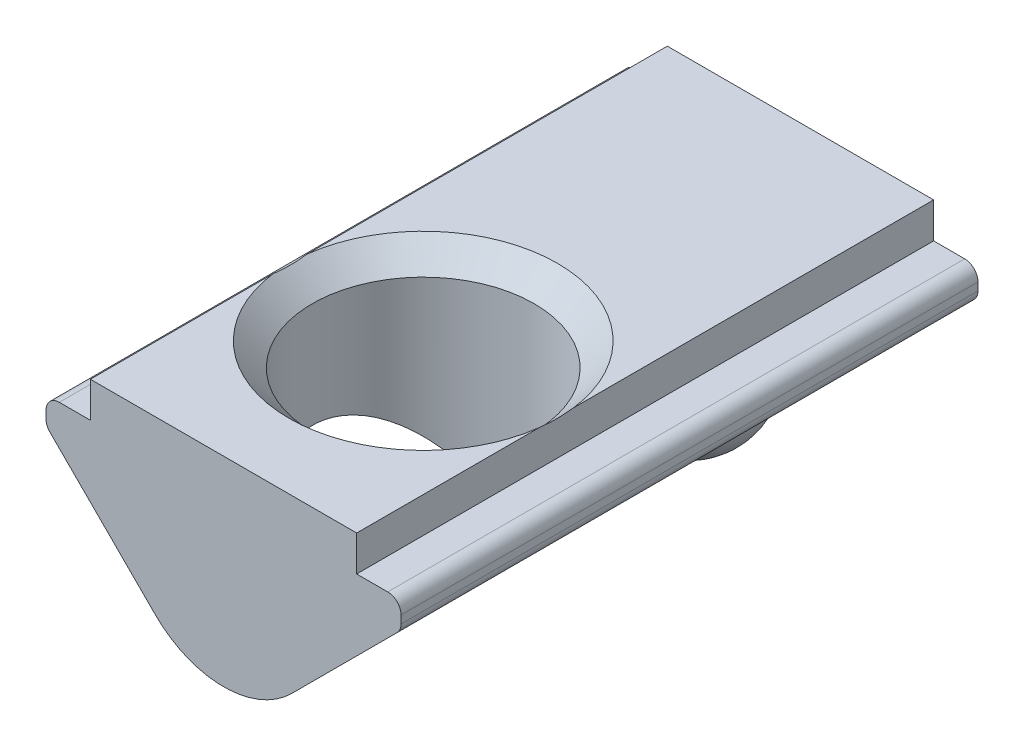
ISO-10303-21;
HEADER;
FILE_DESCRIPTION(('STEP AP214'),'2;1');
FILE_NAME('part.step','',(''),(''),'','','');
FILE_SCHEMA(('AUTOMOTIVE_DESIGN { 1 0 10303 214 1 1 1 1 }'));
ENDSEC;
DATA;
#1=APPLICATION_CONTEXT('core data for automotive mechanical design processes');
#2=APPLICATION_PROTOCOL_DEFINITION('international standard','automotive_design',2000,#1);
#3=PRODUCT_CONTEXT('',#1,'mechanical');
#4=PRODUCT('Part','Part','',(#3));
#5=PRODUCT_RELATED_PRODUCT_CATEGORY('part','',(#4));
#6=PRODUCT_DEFINITION_FORMATION('','',#4);
#7=PRODUCT_DEFINITION_CONTEXT('part definition',#1,'design');
#8=PRODUCT_DEFINITION('design','',#6,#7);
#9=PRODUCT_DEFINITION_SHAPE('','',#8);
#10=(LENGTH_UNIT() NAMED_UNIT(*) SI_UNIT(.MILLI.,.METRE.));
#11=(NAMED_UNIT(*) PLANE_ANGLE_UNIT() SI_UNIT($,.RADIAN.));
#12=(NAMED_UNIT(*) SI_UNIT($,.STERADIAN.) SOLID_ANGLE_UNIT());
#13=UNCERTAINTY_MEASURE_WITH_UNIT(LENGTH_MEASURE(1.E-05),#10,'distance_accuracy_value','');
#14=(GEOMETRIC_REPRESENTATION_CONTEXT(3) GLOBAL_UNCERTAINTY_ASSIGNED_CONTEXT((#13)) GLOBAL_UNIT_ASSIGNED_CONTEXT((#10,
#11,#12)) REPRESENTATION_CONTEXT('',''));
#15=CARTESIAN_POINT('',(0.,0.,0.));
#16=DIRECTION('',(0.,0.,1.));
#17=DIRECTION('',(1.,0.,0.));
#18=AXIS2_PLACEMENT_3D('',#15,#16,#17);
#19=CARTESIAN_POINT('',(-3.,0.,6.5));
#20=DIRECTION('',(0.,-1.,0.));
#21=DIRECTION('',(0.,0.,-1.));
#22=AXIS2_PLACEMENT_3D('',#19,#20,#21);
#23=PLANE('',#22);
#24=CARTESIAN_POINT('',(0.,0.,2.));
#25=DIRECTION('',(0.,1.,0.));
#26=DIRECTION('',(0.,0.,1.));
#27=AXIS2_PLACEMENT_3D('',#24,#25,#26);
#28=CIRCLE('',#27,3.025);
#29=CARTESIAN_POINT('',(3.,0.,1.6118956325935));
#30=VERTEX_POINT('',#29);
#31=CARTESIAN_POINT('',(-3.,0.,1.61189563259351));
#32=VERTEX_POINT('',#31);
#33=EDGE_CURVE('E416',#30,#32,#28,.T.);
#34=ORIENTED_EDGE('',*,*,#33,.F.);
#35=DIRECTION('',(0.,0.,-1.));
#36=VECTOR('',#35,1.);
#37=CARTESIAN_POINT('',(3.,0.,6.5));
#38=LINE('',#37,#36);
#39=CARTESIAN_POINT('',(3.,0.,-6.5));
#40=VERTEX_POINT('',#39);
#41=EDGE_CURVE('E200',#30,#40,#38,.T.);
#42=ORIENTED_EDGE('',*,*,#41,.T.);
#43=DIRECTION('',(-1.,0.,0.));
#44=VECTOR('',#43,1.);
#45=CARTESIAN_POINT('',(-3.,0.,-6.5));
#46=LINE('',#45,#44);
#47=CARTESIAN_POINT('',(-3.,0.,-6.5));
#48=VERTEX_POINT('',#47);
#49=EDGE_CURVE('E306',#40,#48,#46,.T.);
#50=ORIENTED_EDGE('',*,*,#49,.T.);
#51=DIRECTION('',(0.,0.,-1.));
#52=VECTOR('',#51,1.);
#53=CARTESIAN_POINT('',(-3.,0.,6.5));
#54=LINE('',#53,#52);
#55=EDGE_CURVE('E191',#32,#48,#54,.T.);
#56=ORIENTED_EDGE('',*,*,#55,.F.);
#57=EDGE_LOOP('',(#34,#42,#50,#56));
#58=FACE_BOUND('',#57,.T.);
#59=ADVANCED_FACE('F37',(#58),#23,.F.);
#60=CARTESIAN_POINT('',(-3.,0.,2.3881043674065));
#61=VERTEX_POINT('',#60);
#62=CARTESIAN_POINT('',(3.,0.,2.3881043674065));
#63=VERTEX_POINT('',#62);
#64=EDGE_CURVE('E387',#61,#63,#28,.T.);
#65=ORIENTED_EDGE('',*,*,#64,.F.);
#66=CARTESIAN_POINT('',(-3.,0.,6.5));
#67=VERTEX_POINT('',#66);
#68=EDGE_CURVE('E197',#67,#61,#54,.T.);
#69=ORIENTED_EDGE('',*,*,#68,.F.);
#70=DIRECTION('',(-1.,0.,0.));
#71=VECTOR('',#70,1.);
#72=CARTESIAN_POINT('',(-3.,0.,6.5));
#73=LINE('',#72,#71);
#74=CARTESIAN_POINT('',(3.,0.,6.5));
#75=VERTEX_POINT('',#74);
#76=EDGE_CURVE('E283',#75,#67,#73,.T.);
#77=ORIENTED_EDGE('',*,*,#76,.F.);
#78=EDGE_CURVE('E174',#75,#63,#38,.T.);
#79=ORIENTED_EDGE('',*,*,#78,.T.);
#80=EDGE_LOOP('',(#65,#69,#77,#79));
#81=FACE_BOUND('',#80,.T.);
#82=ADVANCED_FACE('F250',(#81),#23,.F.);
#83=CARTESIAN_POINT('',(0.,-2.3272077938642,6.5));
#84=DIRECTION('',(0.,0.,-1.));
#85=DIRECTION('',(-1.,0.,0.));
#86=AXIS2_PLACEMENT_3D('',#83,#84,#85);
#87=CYLINDRICAL_SURFACE('',#86,2.1727922061358);
#88=CARTESIAN_POINT('',(0.,-4.5,-2.8819660112501));
#89=CARTESIAN_POINT('',(0.0842303309173296,-4.49999855111517,-2.88196633157336));
#90=CARTESIAN_POINT('',(0.16847119543235,-4.49507118850862,-2.88710048706043));
#91=CARTESIAN_POINT('',(0.334563064093868,-4.47571560869941,-2.90768842694785));
#92=CARTESIAN_POINT('',(0.416414003630831,-4.4612871348904,-2.9231424900688));
#93=CARTESIAN_POINT('',(0.575407421912194,-4.42401419278143,-2.96452960837165));
#94=CARTESIAN_POINT('',(0.652550469946638,-4.40117074440119,-2.99046139365961));
#95=CARTESIAN_POINT('',(0.800002481194144,-4.34887590636583,-3.05315759958394));
#96=CARTESIAN_POINT('',(0.870305106224547,-4.31941847035847,-3.0899319419261));
#97=CARTESIAN_POINT('',(1.00116691911539,-4.25694776026208,-3.17436574832074));
#98=CARTESIAN_POINT('',(1.06181492041801,-4.22397220182363,-3.22191489589671));
#99=CARTESIAN_POINT('',(1.17182208721126,-4.15803908903499,-3.32863324249409));
#100=CARTESIAN_POINT('',(1.22121213180819,-4.12508173895149,-3.3877698084312));
#101=CARTESIAN_POINT('',(1.29003653326974,-4.07589491550365,-3.49318898289668));
#102=CARTESIAN_POINT('',(1.31374927827934,-4.05803780858356,-3.53593371820567));
#103=CARTESIAN_POINT('',(1.35494043677892,-4.0259840392101,-3.62562018448564));
#104=CARTESIAN_POINT('',(1.37242493804386,-4.01178380614159,-3.67255776072359));
#105=CARTESIAN_POINT('',(1.40045312716439,-3.98856233894596,-3.77025727943218));
#106=CARTESIAN_POINT('',(1.41092788072989,-3.97959264969888,-3.82105188720173));
#107=CARTESIAN_POINT('',(1.42394755705963,-3.96839017175623,-3.9243703584753));
#108=CARTESIAN_POINT('',(1.42650051336135,-3.96615055812741,-3.97689241548578));
#109=CARTESIAN_POINT('',(1.42372574834378,-3.96855713450931,-4.0739698188989));
#110=CARTESIAN_POINT('',(1.41947697116526,-3.97226077313887,-4.11858620613709));
#111=CARTESIAN_POINT('',(1.40528823238396,-3.98439729940903,-4.20623201513968));
#112=CARTESIAN_POINT('',(1.39534706719625,-3.99283118719448,-4.24926109923983));
#113=CARTESIAN_POINT('',(1.37018056785478,-4.01359286620544,-4.33294811804719));
#114=CARTESIAN_POINT('',(1.35493115899743,-4.02593837466991,-4.37359424675713));
#115=CARTESIAN_POINT('',(1.3197164608509,-4.05343910991889,-4.45175680581398));
#116=CARTESIAN_POINT('',(1.29974826616946,-4.0685960664918,-4.48927128864845));
#117=CARTESIAN_POINT('',(1.24459149962959,-4.10868998559647,-4.57882667993944));
#118=CARTESIAN_POINT('',(1.20678188896966,-4.13473099777314,-4.62876623852903));
#119=CARTESIAN_POINT('',(1.12328417546792,-4.18777619812761,-4.72096221660325));
#120=CARTESIAN_POINT('',(1.0775825044373,-4.21478198047074,-4.76320514251109));
#121=CARTESIAN_POINT('',(0.978753321303708,-4.26789532034229,-4.84089967514649));
#122=CARTESIAN_POINT('',(0.925509924549038,-4.29397891100982,-4.87621959826439));
#123=CARTESIAN_POINT('',(0.813471166476377,-4.34290433495116,-4.93942299137123));
#124=CARTESIAN_POINT('',(0.754677240720898,-4.36574700263737,-4.96730837709757));
#125=CARTESIAN_POINT('',(0.621943788707839,-4.41045739012713,-5.02019168950936));
#126=CARTESIAN_POINT('',(0.547158068491612,-4.43144882560476,-5.0438217054878));
#127=CARTESIAN_POINT('',(0.393446841529932,-4.46553276604001,-5.0814366908944));
#128=CARTESIAN_POINT('',(0.314519071093556,-4.47862090182166,-5.09541632591912));
#129=CARTESIAN_POINT('',(0.151400289992606,-4.49633087176125,-5.11422047718119));
#130=CARTESIAN_POINT('',(0.0671249533959798,-4.50059384801617,-5.11865721517349));
#131=CARTESIAN_POINT('',(-0.101254328687025,-4.4992721271511,-5.11727016892315));
#132=CARTESIAN_POINT('',(-0.185358284529483,-4.49368804386192,-5.11144702424526));
#133=CARTESIAN_POINT('',(-0.35113174844667,-4.4730682467818,-5.08947281741961));
#134=CARTESIAN_POINT('',(-0.432797988744982,-4.45802039460013,-5.07330849103682));
#135=CARTESIAN_POINT('',(-0.59130689253848,-4.41958274227056,-5.03045377036557));
#136=CARTESIAN_POINT('',(-0.668147475527518,-4.39618937272923,-5.00375887161402));
#137=CARTESIAN_POINT('',(-0.814718890163093,-4.34297972355502,-4.93953683249765));
#138=CARTESIAN_POINT('',(-0.884452670817997,-4.31316612415247,-4.90201421012796));
#139=CARTESIAN_POINT('',(-1.01464568029042,-4.24989748771758,-4.81561719161915));
#140=CARTESIAN_POINT('',(-1.07511394519103,-4.21644605359357,-4.76675397375317));
#141=CARTESIAN_POINT('',(-1.16928055316175,-4.15913814452597,-4.67234133882737));
#142=CARTESIAN_POINT('',(-1.20575807813653,-4.13518578907621,-4.6296105287969));
#143=CARTESIAN_POINT('',(-1.27154321895058,-4.08953541447432,-4.53788092869314));
#144=CARTESIAN_POINT('',(-1.30086271786266,-4.06783369397031,-4.48889273537551));
#145=CARTESIAN_POINT('',(-1.34593786475505,-4.03311484221702,-4.39570462054));
#146=CARTESIAN_POINT('',(-1.36324195092989,-4.01922938507074,-4.35258183902105));
#147=CARTESIAN_POINT('',(-1.39184227970683,-3.9957835846973,-4.26325869347268));
#148=CARTESIAN_POINT('',(-1.40314330241723,-3.98621980112478,-4.21706081116725));
#149=CARTESIAN_POINT('',(-1.4191946126179,-3.97251305993219,-4.12240949520959));
#150=CARTESIAN_POINT('',(-1.42390185058917,-3.96840573535232,-4.0739433542438));
#151=CARTESIAN_POINT('',(-1.42631627340881,-3.96630869989105,-3.97670811204484));
#152=CARTESIAN_POINT('',(-1.42402551773873,-3.96831718914949,-3.92793910415993));
#153=CARTESIAN_POINT('',(-1.41319292873848,-3.97764775845865,-3.83676111482451));
#154=CARTESIAN_POINT('',(-1.40531306689323,-3.98440650566728,-3.79421108606796));
#155=CARTESIAN_POINT('',(-1.38442633240564,-4.00189412926015,-3.71125363318761));
#156=CARTESIAN_POINT('',(-1.37141722395496,-4.01262473682984,-3.67084715214947));
#157=CARTESIAN_POINT('',(-1.33567747186543,-4.04117041666565,-3.57991300821325));
#158=CARTESIAN_POINT('',(-1.31115458891478,-4.06015479502001,-3.53045776082309));
#159=CARTESIAN_POINT('',(-1.25504465797441,-4.10121464460792,-3.4371457552608));
#160=CARTESIAN_POINT('',(-1.22344388269068,-4.12329609094912,-3.39330013994697));
#161=CARTESIAN_POINT('',(-1.14450321349988,-4.17488927914732,-3.29987057606816));
#162=CARTESIAN_POINT('',(-1.09523337930063,-4.20475155208763,-3.25211268447254));
#163=CARTESIAN_POINT('',(-0.988587325079709,-4.26303461411386,-3.16570684057961));
#164=CARTESIAN_POINT('',(-0.931206372423186,-4.29145454838024,-3.12706424220901));
#165=CARTESIAN_POINT('',(-0.8090743005586,-4.34486106466388,-3.05802658700122));
#166=CARTESIAN_POINT('',(-0.744235105523627,-4.36979681047844,-3.02774837988607));
#167=CARTESIAN_POINT('',(-0.609408359556503,-4.41399563728596,-2.9758213360058));
#168=CARTESIAN_POINT('',(-0.539421907015559,-4.4332599241669,-2.95417066447338));
#169=CARTESIAN_POINT('',(-0.392349601983774,-4.46567193528795,-2.91841938093128));
#170=CARTESIAN_POINT('',(-0.315083894665737,-4.47847295264263,-2.90474160136218));
#171=CARTESIAN_POINT('',(-0.158548954341807,-4.49563889887239,-2.88651343280822));
#172=CARTESIAN_POINT('',(-0.0792791429869385,-4.50000136371716,-2.88196570975594));
#173=CARTESIAN_POINT('',(0.,-4.5,-2.8819660112501));
#174=B_SPLINE_CURVE_WITH_KNOTS('',3,(#88,#89,#90,#91,#92,#93,#94,#95,#96,#97,#98,#99,#100,#101,
#102,#103,#104,#105,#106,#107,#108,#109,#110,#111,#112,#113,#114,#115,#116,#117,#118,#119,#120,
#121,#122,#123,#124,#125,#126,#127,#128,#129,#130,#131,#132,#133,#134,#135,#136,#137,#138,#139,
#140,#141,#142,#143,#144,#145,#146,#147,#148,#149,#150,#151,#152,#153,#154,#155,#156,#157,#158,
#159,#160,#161,#162,#163,#164,#165,#166,#167,#168,#169,#170,#171,#172,#173),.UNSPECIFIED.,.T.,
.F.,(4,2,2,2,2,2,2,2,2,2,2,2,2,2,2,2,2,2,2,2,2,2,2,2,2,2,2,2,2,2,2,2,2,2,2,2,2,2,2,2,2,2,4),(0.,
0.252411735178092,0.504830287780983,0.757218256572261,1.0098378987951,1.25997946392424,
1.50942643822576,1.66499879554141,1.8204186692244,1.97734533181334,2.1341128021284,
2.26837014720749,2.40265588982667,2.53755877486978,2.67254493805455,2.87494155135125,
3.07768965770269,3.2839833704589,3.49022387379938,3.73269674695461,3.97530354380059,
4.22759586219719,4.4798724541404,4.7324732820823,4.98518227765419,5.23778597952022,
5.49014174289248,5.67272997324359,5.85501299481085,5.99992791480923,6.14472726858611,
6.29046765108396,6.43616514690186,6.56699003630751,6.69787201466712,6.87204089572346,
7.04655054134616,7.26987921484621,7.49333873707935,7.71977802563765,7.9461691329506,
8.18367437921688,8.42124896579195),.UNSPECIFIED.);
#175=CARTESIAN_POINT('',(0.,-4.5,-2.8819660112501));
#176=VERTEX_POINT('',#175);
#177=EDGE_CURVE('E382',#176,#176,#174,.T.);
#178=ORIENTED_EDGE('',*,*,#177,.T.);
#179=EDGE_LOOP('',(#178));
#180=FACE_BOUND('',#179,.T.);
#181=DIRECTION('',(0.,0.,-1.));
#182=VECTOR('',#181,1.);
#183=CARTESIAN_POINT('',(1.53639610306791,-3.8636038969321,6.5));
#184=LINE('',#183,#182);
#185=CARTESIAN_POINT('',(1.53639610306791,-3.8636038969321,0.0278217589483104));
#186=VERTEX_POINT('',#185);
#187=CARTESIAN_POINT('',(1.53639610306791,-3.8636038969321,-6.5));
#188=VERTEX_POINT('',#187);
#189=EDGE_CURVE('E328',#186,#188,#184,.T.);
#190=ORIENTED_EDGE('',*,*,#189,.F.);
#191=CARTESIAN_POINT('',(1.53639610306791,-3.8636038969321,0.0278217589483091));
#192=CARTESIAN_POINT('',(1.49772985057565,-3.90225516750843,-0.0022962912029301));
#193=CARTESIAN_POINT('',(1.45742167493974,-3.93965773218882,-0.0318729386616087));
#194=CARTESIAN_POINT('',(1.37340828217229,-4.01180284845711,-0.0895833308137787));
#195=CARTESIAN_POINT('',(1.32969848849589,-4.04654168709508,-0.117715044028378));
#196=CARTESIAN_POINT('',(1.1928626962568,-4.14680295609409,-0.199637538467938));
#197=CARTESIAN_POINT('',(1.09453955164601,-4.20785332014456,-0.25054679167035));
#198=CARTESIAN_POINT('',(0.903559179691048,-4.30559430603407,-0.332901237662458));
#199=CARTESIAN_POINT('',(0.812924309329167,-4.34467850054579,-0.366193701853745));
#200=CARTESIAN_POINT('',(0.624591908762579,-4.41067005886615,-0.422704643247891));
#201=CARTESIAN_POINT('',(0.526917453638704,-4.43761527992482,-0.445954430601593));
#202=CARTESIAN_POINT('',(0.325953260981073,-4.47787010703824,-0.480769829504096));
#203=CARTESIAN_POINT('',(0.222627735268849,-4.49107873153778,-0.492248902741842));
#204=CARTESIAN_POINT('',(0.0144640492252478,-4.50244867365084,-0.502126681857763));
#205=CARTESIAN_POINT('',(-0.0903745379230912,-4.5006056591508,-0.500521621903713));
#206=CARTESIAN_POINT('',(-0.286636205094478,-4.48302271041401,-0.485256011890902));
#207=CARTESIAN_POINT('',(-0.37830330699702,-4.46877664779523,-0.472891456332652));
#208=CARTESIAN_POINT('',(-0.557365980906507,-4.42929619135658,-0.438780660518509));
#209=CARTESIAN_POINT('',(-0.644762191890556,-4.4040634469102,-0.417035828479357));
#210=CARTESIAN_POINT('',(-0.817562137052058,-4.34250682925276,-0.364347394394588));
#211=CARTESIAN_POINT('',(-0.902680340877034,-4.30571841650192,-0.333020308670282));
#212=CARTESIAN_POINT('',(-1.06538164815314,-4.22307917579466,-0.263362185582804));
#213=CARTESIAN_POINT('',(-1.14295546750354,-4.17721738748682,-0.225022681711105));
#214=CARTESIAN_POINT('',(-1.27507538013307,-4.08795276400947,-0.151438783618896));
#215=CARTESIAN_POINT('',(-1.33110434063375,-4.0459311421865,-0.117138656009895));
#216=CARTESIAN_POINT('',(-1.43773509781986,-3.9577578418711,-0.0462167475275637));
#217=CARTESIAN_POINT('',(-1.48835884658811,-3.91162438332461,-0.00960539976374466));
#218=CARTESIAN_POINT('',(-1.53639610306791,-3.8636038969321,0.0278217589483079));
#219=B_SPLINE_CURVE_WITH_KNOTS('',3,(#191,#192,#193,#194,#195,#196,#197,#198,#199,#200,#201,
#202,#203,#204,#205,#206,#207,#208,#209,#210,#211,#212,#213,#214,#215,#216,#217,#218),
.UNSPECIFIED.,.F.,.F.,(4,2,2,2,2,2,2,2,2,2,2,2,2,4),(0.,0.187173339806686,0.374603007564737,
0.751936436324784,1.06320048039801,1.37348696346671,1.68603866293274,1.99868032317739,
2.27817999773316,2.55763772691345,2.85019778905891,3.14311343638918,3.37674036607021,
3.60937916230131),.UNSPECIFIED.);
#220=CARTESIAN_POINT('',(-1.53639610306791,-3.8636038969321,0.0278217589483095));
#221=VERTEX_POINT('',#220);
#222=EDGE_CURVE('E173',#186,#221,#219,.T.);
#223=ORIENTED_EDGE('',*,*,#222,.T.);
#224=DIRECTION('',(0.,0.,-1.));
#225=VECTOR('',#224,1.);
#226=CARTESIAN_POINT('',(-1.53639610306791,-3.8636038969321,6.5));
#227=LINE('',#226,#225);
#228=CARTESIAN_POINT('',(-1.53639610306791,-3.8636038969321,-6.5));
#229=VERTEX_POINT('',#228);
#230=EDGE_CURVE('E183',#221,#229,#227,.T.);
#231=ORIENTED_EDGE('',*,*,#230,.T.);
#232=CARTESIAN_POINT('',(0.,-2.3272077938642,-6.5));
#233=DIRECTION('',(0.,0.,1.));
#234=DIRECTION('',(-1.,0.,0.));
#235=AXIS2_PLACEMENT_3D('',#232,#233,#234);
#236=CIRCLE('',#235,2.1727922061358);
#237=EDGE_CURVE('E319',#229,#188,#236,.T.);
#238=ORIENTED_EDGE('',*,*,#237,.T.);
#239=EDGE_LOOP('',(#190,#223,#231,#238));
#240=FACE_BOUND('',#239,.T.);
#241=ADVANCED_FACE('F247',(#180,#240),#87,.T.);
#242=CARTESIAN_POINT('',(3.,0.,6.5));
#243=DIRECTION('',(-1.,0.,0.));
#244=DIRECTION('',(0.,0.,1.));
#245=AXIS2_PLACEMENT_3D('',#242,#243,#244);
#246=PLANE('',#245);
#247=ORIENTED_EDGE('',*,*,#41,.F.);
#248=CARTESIAN_POINT('',(3.,0.592945403637052,-0.0222583770869814));
#249=CARTESIAN_POINT('',(3.,0.534471590119765,0.0824577891761707));
#250=CARTESIAN_POINT('',(3.,0.478246838017266,0.188541344410611));
#251=CARTESIAN_POINT('',(3.,0.371737138156331,0.404145954408068));
#252=CARTESIAN_POINT('',(3.,0.321476116700631,0.513678763348997));
#253=CARTESIAN_POINT('',(3.,0.228213478330012,0.737520825280906));
#254=CARTESIAN_POINT('',(3.,0.185314716805498,0.85187365852731));
#255=CARTESIAN_POINT('',(3.,0.109867038797913,1.08382703450607));
#256=CARTESIAN_POINT('',(3.,0.0773016211669852,1.20142207003413));
#257=CARTESIAN_POINT('',(3.,0.0345253262479036,1.3950206903332));
#258=CARTESIAN_POINT('',(3.,0.0205065035760664,1.47018884540691));
#259=CARTESIAN_POINT('',(3.,-0.0021214252142781,1.62135231743092));
#260=CARTESIAN_POINT('',(3.,-0.0107302632190426,1.69734767518675));
#261=CARTESIAN_POINT('',(3.,-0.0221584236765544,1.84918908773164));
#262=CARTESIAN_POINT('',(3.,-0.0250217191868552,1.92503180365652));
#263=CARTESIAN_POINT('',(3.,-0.0249780262900468,2.07671586548121));
#264=CARTESIAN_POINT('',(3.,-0.0220708927867678,2.15255721129861));
#265=CARTESIAN_POINT('',(3.,-0.00976674722846215,2.3147718953705));
#266=CARTESIAN_POINT('',(3.,0.000509604019840753,2.40107896584502));
#267=CARTESIAN_POINT('',(3.,0.0279796000935074,2.57258987387537));
#268=CARTESIAN_POINT('',(3.,0.0451750949190716,2.65779341008079));
#269=CARTESIAN_POINT('',(3.,0.0859835717727935,2.82771105627076));
#270=CARTESIAN_POINT('',(3.,0.109670813184562,2.91240713941116));
#271=CARTESIAN_POINT('',(3.,0.162499756043947,3.08003877254894));
#272=CARTESIAN_POINT('',(3.,0.191640239103376,3.16297471120624));
#273=CARTESIAN_POINT('',(3.,0.266657580243521,3.35869119483352));
#274=CARTESIAN_POINT('',(3.,0.314656405887987,3.4706556895066));
#275=CARTESIAN_POINT('',(3.,0.417563985628333,3.69138691748606));
#276=CARTESIAN_POINT('',(3.,0.472476608131685,3.80015181819619));
#277=CARTESIAN_POINT('',(3.,0.587856781576656,4.01519102488546));
#278=CARTESIAN_POINT('',(3.,0.648344170376918,4.12145460338142));
#279=CARTESIAN_POINT('',(3.,0.773492788297369,4.33144866737361));
#280=CARTESIAN_POINT('',(3.,0.838153192129185,4.43517964817728));
#281=CARTESIAN_POINT('',(3.,0.967478333632576,4.63541816240215));
#282=CARTESIAN_POINT('',(3.,1.03198407125381,4.73202892233677));
#283=CARTESIAN_POINT('',(3.,1.16339443505524,4.92361133437606));
#284=CARTESIAN_POINT('',(3.,1.23029925583097,5.01858285258806));
#285=CARTESIAN_POINT('',(3.,1.36544826197279,5.20628263381108));
#286=CARTESIAN_POINT('',(3.,1.43367522635756,5.29902333934095));
#287=CARTESIAN_POINT('',(3.,1.57169893666245,5.4832919928495));
#288=CARTESIAN_POINT('',(3.,1.64149526015345,5.57482025688854));
#289=CARTESIAN_POINT('',(3.,1.71192490520327,5.66585018209078));
#290=B_SPLINE_CURVE_WITH_KNOTS('',3,(#248,#249,#250,#251,#252,#253,#254,#255,#256,#257,#258,
#259,#260,#261,#262,#263,#264,#265,#266,#267,#268,#269,#270,#271,#272,#273,#274,#275,#276,#277,
#278,#279,#280,#281,#282,#283,#284,#285,#286,#287,#288,#289),.UNSPECIFIED.,.F.,.F.,(4,2,2,2,2,2,
2,2,2,2,2,2,2,2,2,2,2,2,2,2,4),(0.,0.359927475938538,0.721253357611177,1.08727601254783,
1.45271119557327,1.68193289351404,1.9111659505705,2.13863779480312,2.36611535883774,
2.62655418002846,2.88706268215015,3.15068538728236,3.41424926279363,3.77938620550692,
4.14472836518513,4.51142487237123,4.87804907968707,5.22650528953113,5.57498982773783,
5.92037270128504,6.26566369443464),.UNSPECIFIED.);
#291=EDGE_CURVE('E271',#30,#63,#290,.T.);
#292=ORIENTED_EDGE('',*,*,#291,.T.);
#293=ORIENTED_EDGE('',*,*,#78,.F.);
#294=DIRECTION('',(0.,1.,0.));
#295=VECTOR('',#294,1.);
#296=CARTESIAN_POINT('',(3.,0.,6.5));
#297=LINE('',#296,#295);
#298=CARTESIAN_POINT('',(3.,-0.8,6.5));
#299=VERTEX_POINT('',#298);
#300=EDGE_CURVE('E280',#299,#75,#297,.T.);
#301=ORIENTED_EDGE('',*,*,#300,.F.);
#302=DIRECTION('',(0.,0.,-1.));
#303=VECTOR('',#302,1.);
#304=CARTESIAN_POINT('',(3.,-0.8,6.5));
#305=LINE('',#304,#303);
#306=CARTESIAN_POINT('',(3.,-0.8,-6.5));
#307=VERTEX_POINT('',#306);
#308=EDGE_CURVE('E303',#299,#307,#305,.T.);
#309=ORIENTED_EDGE('',*,*,#308,.T.);
#310=DIRECTION('',(0.,1.,0.));
#311=VECTOR('',#310,1.);
#312=CARTESIAN_POINT('',(3.,0.,-6.5));
#313=LINE('',#312,#311);
#314=EDGE_CURVE('E279',#307,#40,#313,.T.);
#315=ORIENTED_EDGE('',*,*,#314,.T.);
#316=EDGE_LOOP('',(#247,#292,#293,#301,#309,#315));
#317=FACE_BOUND('',#316,.T.);
#318=ADVANCED_FACE('F263',(#317),#246,.F.);
#319=CARTESIAN_POINT('',(-3.,0.,6.5));
#320=DIRECTION('',(1.,0.,0.));
#321=DIRECTION('',(0.,0.,-1.));
#322=AXIS2_PLACEMENT_3D('',#319,#320,#321);
#323=PLANE('',#322);
#324=ORIENTED_EDGE('',*,*,#68,.T.);
#325=CARTESIAN_POINT('',(-3.,0.592945403637052,-0.0222583770869814));
#326=CARTESIAN_POINT('',(-3.,0.534471590119765,0.0824577891761707));
#327=CARTESIAN_POINT('',(-3.,0.478246838017266,0.188541344410611));
#328=CARTESIAN_POINT('',(-3.,0.371737138156331,0.404145954408068));
#329=CARTESIAN_POINT('',(-3.,0.321476116700631,0.513678763348997));
#330=CARTESIAN_POINT('',(-3.,0.228213478330012,0.737520825280906));
#331=CARTESIAN_POINT('',(-3.,0.185314716805498,0.85187365852731));
#332=CARTESIAN_POINT('',(-3.,0.109867038797913,1.08382703450607));
#333=CARTESIAN_POINT('',(-3.,0.0773016211669852,1.20142207003413));
#334=CARTESIAN_POINT('',(-3.,0.0345253262479036,1.3950206903332));
#335=CARTESIAN_POINT('',(-3.,0.0205065035760664,1.47018884540691));
#336=CARTESIAN_POINT('',(-3.,-0.0021214252142781,1.62135231743092));
#337=CARTESIAN_POINT('',(-3.,-0.0107302632190426,1.69734767518675));
#338=CARTESIAN_POINT('',(-3.,-0.0221584236765544,1.84918908773164));
#339=CARTESIAN_POINT('',(-3.,-0.0250217191868552,1.92503180365652));
#340=CARTESIAN_POINT('',(-3.,-0.0249780262900468,2.07671586548121));
#341=CARTESIAN_POINT('',(-3.,-0.0220708927867678,2.15255721129861));
#342=CARTESIAN_POINT('',(-3.,-0.00976674722846215,2.3147718953705));
#343=CARTESIAN_POINT('',(-3.,0.000509604019840753,2.40107896584502));
#344=CARTESIAN_POINT('',(-3.,0.0279796000935074,2.57258987387537));
#345=CARTESIAN_POINT('',(-3.,0.0451750949190716,2.65779341008079));
#346=CARTESIAN_POINT('',(-3.,0.0859835717727935,2.82771105627076));
#347=CARTESIAN_POINT('',(-3.,0.109670813184562,2.91240713941116));
#348=CARTESIAN_POINT('',(-3.,0.162499756043947,3.08003877254894));
#349=CARTESIAN_POINT('',(-3.,0.191640239103376,3.16297471120624));
#350=CARTESIAN_POINT('',(-3.,0.266657580243521,3.35869119483352));
#351=CARTESIAN_POINT('',(-3.,0.314656405887987,3.4706556895066));
#352=CARTESIAN_POINT('',(-3.,0.417563985628333,3.69138691748606));
#353=CARTESIAN_POINT('',(-3.,0.472476608131685,3.80015181819619));
#354=CARTESIAN_POINT('',(-3.,0.587856781576656,4.01519102488546));
#355=CARTESIAN_POINT('',(-3.,0.648344170376918,4.12145460338142));
#356=CARTESIAN_POINT('',(-3.,0.773492788297369,4.33144866737361));
#357=CARTESIAN_POINT('',(-3.,0.838153192129185,4.43517964817728));
#358=CARTESIAN_POINT('',(-3.,0.967478333632576,4.63541816240215));
#359=CARTESIAN_POINT('',(-3.,1.03198407125381,4.73202892233677));
#360=CARTESIAN_POINT('',(-3.,1.16339443505524,4.92361133437606));
#361=CARTESIAN_POINT('',(-3.,1.23029925583097,5.01858285258806));
#362=CARTESIAN_POINT('',(-3.,1.36544826197279,5.20628263381108));
#363=CARTESIAN_POINT('',(-3.,1.43367522635756,5.29902333934095));
#364=CARTESIAN_POINT('',(-3.,1.57169893666245,5.4832919928495));
#365=CARTESIAN_POINT('',(-3.,1.64149526015345,5.57482025688854));
#366=CARTESIAN_POINT('',(-3.,1.71192490520327,5.66585018209078));
#367=B_SPLINE_CURVE_WITH_KNOTS('',3,(#325,#326,#327,#328,#329,#330,#331,#332,#333,#334,#335,
#336,#337,#338,#339,#340,#341,#342,#343,#344,#345,#346,#347,#348,#349,#350,#351,#352,#353,#354,
#355,#356,#357,#358,#359,#360,#361,#362,#363,#364,#365,#366),.UNSPECIFIED.,.F.,.F.,(4,2,2,2,2,2,
2,2,2,2,2,2,2,2,2,2,2,2,2,2,4),(0.,0.359927475938538,0.721253357611177,1.08727601254783,
1.45271119557327,1.68193289351404,1.9111659505705,2.13863779480312,2.36611535883774,
2.62655418002846,2.88706268215015,3.15068538728236,3.41424926279363,3.77938620550692,
4.14472836518513,4.51142487237123,4.87804907968707,5.22650528953113,5.57498982773783,
5.92037270128504,6.26566369443464),.UNSPECIFIED.);
#368=EDGE_CURVE('E381',#61,#32,#367,.F.);
#369=ORIENTED_EDGE('',*,*,#368,.T.);
#370=ORIENTED_EDGE('',*,*,#55,.T.);
#371=DIRECTION('',(0.,-1.,0.));
#372=VECTOR('',#371,1.);
#373=CARTESIAN_POINT('',(-3.,0.,-6.5));
#374=LINE('',#373,#372);
#375=CARTESIAN_POINT('',(-3.,-0.8,-6.5));
#376=VERTEX_POINT('',#375);
#377=EDGE_CURVE('E309',#48,#376,#374,.T.);
#378=ORIENTED_EDGE('',*,*,#377,.T.);
#379=DIRECTION('',(0.,0.,-1.));
#380=VECTOR('',#379,1.);
#381=CARTESIAN_POINT('',(-3.,-0.8,6.5));
#382=LINE('',#381,#380);
#383=CARTESIAN_POINT('',(-3.,-0.8,6.5));
#384=VERTEX_POINT('',#383);
#385=EDGE_CURVE('E188',#384,#376,#382,.T.);
#386=ORIENTED_EDGE('',*,*,#385,.F.);
#387=DIRECTION('',(0.,-1.,0.));
#388=VECTOR('',#387,1.);
#389=CARTESIAN_POINT('',(-3.,0.,6.5));
#390=LINE('',#389,#388);
#391=EDGE_CURVE('E286',#67,#384,#390,.T.);
#392=ORIENTED_EDGE('',*,*,#391,.F.);
#393=EDGE_LOOP('',(#324,#369,#370,#378,#386,#392));
#394=FACE_BOUND('',#393,.T.);
#395=ADVANCED_FACE('F260',(#394),#323,.F.);
#396=CARTESIAN_POINT('',(-3.,-0.8,6.5));
#397=DIRECTION('',(0.,-1.,0.));
#398=DIRECTION('',(1.,0.,0.));
#399=AXIS2_PLACEMENT_3D('',#396,#397,#398);
#400=PLANE('',#399);
#401=DIRECTION('',(-1.,0.,0.));
#402=VECTOR('',#401,1.);
#403=CARTESIAN_POINT('',(-3.,-0.8,-6.5));
#404=LINE('',#403,#402);
#405=CARTESIAN_POINT('',(-3.7,-0.8,-6.5));
#406=VERTEX_POINT('',#405);
#407=EDGE_CURVE('E311',#376,#406,#404,.T.);
#408=ORIENTED_EDGE('',*,*,#407,.T.);
#409=DIRECTION('',(0.,0.,-1.));
#410=VECTOR('',#409,1.);
#411=CARTESIAN_POINT('',(-3.7,-0.8,6.5));
#412=LINE('',#411,#410);
#413=CARTESIAN_POINT('',(-3.7,-0.8,6.5));
#414=VERTEX_POINT('',#413);
#415=EDGE_CURVE('E45',#406,#414,#412,.F.);
#416=ORIENTED_EDGE('',*,*,#415,.T.);
#417=DIRECTION('',(-1.,0.,0.));
#418=VECTOR('',#417,1.);
#419=CARTESIAN_POINT('',(-3.,-0.8,6.5));
#420=LINE('',#419,#418);
#421=EDGE_CURVE('E288',#384,#414,#420,.T.);
#422=ORIENTED_EDGE('',*,*,#421,.F.);
#423=ORIENTED_EDGE('',*,*,#385,.T.);
#424=EDGE_LOOP('',(#408,#416,#422,#423));
#425=FACE_BOUND('',#424,.T.);
#426=ADVANCED_FACE('F358',(#425),#400,.F.);
#427=CARTESIAN_POINT('',(-4.,-0.8,6.5));
#428=DIRECTION('',(1.,0.,0.));
#429=DIRECTION('',(0.,0.,-1.));
#430=AXIS2_PLACEMENT_3D('',#427,#428,#429);
#431=PLANE('',#430);
#432=DIRECTION('',(0.,-1.,0.));
#433=VECTOR('',#432,1.);
#434=CARTESIAN_POINT('',(-4.,-0.8,6.5));
#435=LINE('',#434,#433);
#436=CARTESIAN_POINT('',(-4.,-1.1,6.5));
#437=VERTEX_POINT('',#436);
#438=CARTESIAN_POINT('',(-4.,-1.27573593128807,6.5));
#439=VERTEX_POINT('',#438);
#440=EDGE_CURVE('E291',#437,#439,#435,.T.);
#441=ORIENTED_EDGE('',*,*,#440,.F.);
#442=DIRECTION('',(0.,0.,-1.));
#443=VECTOR('',#442,1.);
#444=CARTESIAN_POINT('',(-4.,-1.1,6.5));
#445=LINE('',#444,#443);
#446=CARTESIAN_POINT('',(-4.,-1.1,-6.5));
#447=VERTEX_POINT('',#446);
#448=EDGE_CURVE('E353',#437,#447,#445,.T.);
#449=ORIENTED_EDGE('',*,*,#448,.T.);
#450=DIRECTION('',(0.,-1.,0.));
#451=VECTOR('',#450,1.);
#452=CARTESIAN_POINT('',(-4.,-0.8,-6.5));
#453=LINE('',#452,#451);
#454=CARTESIAN_POINT('',(-4.,-1.27573593128807,-6.5));
#455=VERTEX_POINT('',#454);
#456=EDGE_CURVE('E314',#447,#455,#453,.T.);
#457=ORIENTED_EDGE('',*,*,#456,.T.);
#458=DIRECTION('',(0.,0.,-1.));
#459=VECTOR('',#458,1.);
#460=CARTESIAN_POINT('',(-4.,-1.27573593128807,6.5));
#461=LINE('',#460,#459);
#462=EDGE_CURVE('E346',#455,#439,#461,.F.);
#463=ORIENTED_EDGE('',*,*,#462,.T.);
#464=EDGE_LOOP('',(#441,#449,#457,#463));
#465=FACE_BOUND('',#464,.T.);
#466=ADVANCED_FACE('F427',(#465),#431,.F.);
#467=CARTESIAN_POINT('',(-1.53639610306791,-3.8636038969321,6.5));
#468=DIRECTION('',(0.707106781186548,0.707106781186547,0.));
#469=DIRECTION('',(-0.707106781186547,0.707106781186548,0.));
#470=AXIS2_PLACEMENT_3D('',#467,#468,#469);
#471=PLANE('',#470);
#472=DIRECTION('',(0.707106781186547,-0.707106781186548,0.));
#473=VECTOR('',#472,1.);
#474=CARTESIAN_POINT('',(-1.53639610306791,-3.8636038969321,6.5));
#475=LINE('',#474,#473);
#476=CARTESIAN_POINT('',(-3.91213203435596,-1.48786796564404,6.5));
#477=VERTEX_POINT('',#476);
#478=CARTESIAN_POINT('',(-1.53639610306791,-3.8636038969321,6.5));
#479=VERTEX_POINT('',#478);
#480=EDGE_CURVE('E293',#477,#479,#475,.T.);
#481=ORIENTED_EDGE('',*,*,#480,.F.);
#482=DIRECTION('',(0.,0.,-1.));
#483=VECTOR('',#482,1.);
#484=CARTESIAN_POINT('',(-3.91213203435596,-1.48786796564404,6.5));
#485=LINE('',#484,#483);
#486=CARTESIAN_POINT('',(-3.91213203435596,-1.48786796564404,-6.5));
#487=VERTEX_POINT('',#486);
#488=EDGE_CURVE('E11',#477,#487,#485,.T.);
#489=ORIENTED_EDGE('',*,*,#488,.T.);
#490=DIRECTION('',(0.707106781186547,-0.707106781186548,0.));
#491=VECTOR('',#490,1.);
#492=CARTESIAN_POINT('',(-1.53639610306791,-3.8636038969321,-6.5));
#493=LINE('',#492,#491);
#494=EDGE_CURVE('E317',#487,#229,#493,.T.);
#495=ORIENTED_EDGE('',*,*,#494,.T.);
#496=ORIENTED_EDGE('',*,*,#230,.F.);
#497=CARTESIAN_POINT('',(0.,-5.40000000000001,2.));
#498=DIRECTION('',(0.707106781186548,0.707106781186547,0.));
#499=DIRECTION('',(-0.707106781186547,0.707106781186548,0.));
#500=AXIS2_PLACEMENT_3D('',#497,#498,#499);
#501=ELLIPSE('',#500,3.53553390593274,2.5);
#502=CARTESIAN_POINT('',(-1.53639610306791,-3.8636038969321,3.97217824105169));
#503=VERTEX_POINT('',#502);
#504=EDGE_CURVE('E165',#221,#503,#501,.T.);
#505=ORIENTED_EDGE('',*,*,#504,.T.);
#506=EDGE_CURVE('E180',#479,#503,#227,.T.);
#507=ORIENTED_EDGE('',*,*,#506,.F.);
#508=EDGE_LOOP('',(#481,#489,#495,#496,#505,#507));
#509=FACE_BOUND('',#508,.T.);
#510=ADVANCED_FACE('F179',(#509),#471,.F.);
#511=ORIENTED_EDGE('',*,*,#506,.T.);
#512=CARTESIAN_POINT('',(-1.53639610306791,-3.8636038969321,3.97217824105169));
#513=CARTESIAN_POINT('',(-1.49774417402599,-3.90224045395612,4.00228481045936));
#514=CARTESIAN_POINT('',(-1.45745223834724,-3.93962919447707,4.03185036282142));
#515=CARTESIAN_POINT('',(-1.37347307131089,-4.01174951480325,4.08954041220075));
#516=CARTESIAN_POINT('',(-1.32978120109108,-4.04647733122949,4.11766285030364));
#517=CARTESIAN_POINT('',(-1.19293439277018,-4.14675794487418,4.19959997114731));
#518=CARTESIAN_POINT('',(-1.09457395808454,-4.20783371910449,4.25053019957331));
#519=CARTESIAN_POINT('',(-0.903507918229761,-4.30562218481898,4.33292479099853));
#520=CARTESIAN_POINT('',(-0.812821467287682,-4.34472760176653,4.36623573958798));
#521=CARTESIAN_POINT('',(-0.62445520740033,-4.41070495222953,4.42273453523394));
#522=CARTESIAN_POINT('',(-0.526807953451141,-4.43762999952625,4.44596631503142));
#523=CARTESIAN_POINT('',(-0.357269589341215,-4.47160219743194,4.47534945867999));
#524=CARTESIAN_POINT('',(-0.286597625550495,-4.48220649583038,4.48454844807217));
#525=CARTESIAN_POINT('',(-0.143962418892979,-4.49641097631116,4.49687886275012));
#526=CARTESIAN_POINT('',(-0.0719981364758468,-4.50000523904809,4.50000516018402));
#527=CARTESIAN_POINT('',(0.101868100710412,-4.49999258742095,4.49999269900345));
#528=CARTESIAN_POINT('',(0.203803972538734,-4.49277947280337,4.49371665530617));
#529=CARTESIAN_POINT('',(0.404223152096952,-4.46447319543167,4.4691759550949));
#530=CARTESIAN_POINT('',(0.502704132266409,-4.44337085772387,4.45090337391897));
#531=CARTESIAN_POINT('',(0.692808397982851,-4.38894539727161,4.40406831513114));
#532=CARTESIAN_POINT('',(0.78447340655959,-4.35570554680576,4.37557597563174));
#533=CARTESIAN_POINT('',(0.960165688519069,-4.27870229800715,4.31017204330923));
#534=CARTESIAN_POINT('',(1.04417944012129,-4.2349207487338,4.27324593472999));
#535=CARTESIAN_POINT('',(1.20098362120129,-4.14016073500289,4.19433182827573));
#536=CARTESIAN_POINT('',(1.27405049104115,-4.08946315088787,4.15254789215301));
#537=CARTESIAN_POINT('',(1.41155927717028,-3.98132545986955,4.06497510277519));
#538=CARTESIAN_POINT('',(1.47604849297068,-3.92392591330816,4.019210729476));
#539=CARTESIAN_POINT('',(1.53639610306791,-3.8636038969321,3.97217824105169));
#540=B_SPLINE_CURVE_WITH_KNOTS('',3,(#512,#513,#514,#515,#516,#517,#518,#519,#520,#521,#522,
#523,#524,#525,#526,#527,#528,#529,#530,#531,#532,#533,#534,#535,#536,#537,#538,#539),
.UNSPECIFIED.,.F.,.F.,(4,2,2,2,2,2,2,2,2,2,2,2,2,4),(0.,0.187101927650173,0.374463770227778,
0.751936062843365,1.06339715350178,1.37348667487625,1.58908026797613,1.80485583181442,
2.11015049559088,2.4156470338306,2.71908585537959,3.02305092884299,3.31711485764672,
3.60948331716817),.UNSPECIFIED.);
#541=CARTESIAN_POINT('',(1.53639610306791,-3.8636038969321,3.97217824105169));
#542=VERTEX_POINT('',#541);
#543=EDGE_CURVE('E162',#503,#542,#540,.T.);
#544=ORIENTED_EDGE('',*,*,#543,.T.);
#545=CARTESIAN_POINT('',(1.53639610306791,-3.8636038969321,6.5));
#546=VERTEX_POINT('',#545);
#547=EDGE_CURVE('E193',#546,#542,#184,.T.);
#548=ORIENTED_EDGE('',*,*,#547,.F.);
#549=CARTESIAN_POINT('',(0.,-2.3272077938642,6.5));
#550=DIRECTION('',(0.,0.,1.));
#551=DIRECTION('',(-1.,0.,0.));
#552=AXIS2_PLACEMENT_3D('',#549,#550,#551);
#553=CIRCLE('',#552,2.1727922061358);
#554=EDGE_CURVE('E187',#479,#546,#553,.T.);
#555=ORIENTED_EDGE('',*,*,#554,.F.);
#556=EDGE_LOOP('',(#511,#544,#548,#555));
#557=FACE_BOUND('',#556,.T.);
#558=ADVANCED_FACE('F186',(#557),#87,.T.);
#559=CARTESIAN_POINT('',(4.,-1.4,6.5));
#560=DIRECTION('',(-0.707106781186548,0.707106781186547,0.));
#561=DIRECTION('',(-0.707106781186547,-0.707106781186548,0.));
#562=AXIS2_PLACEMENT_3D('',#559,#560,#561);
#563=PLANE('',#562);
#564=DIRECTION('',(0.707106781186547,0.707106781186548,0.));
#565=VECTOR('',#564,1.);
#566=CARTESIAN_POINT('',(4.,-1.4,-6.5));
#567=LINE('',#566,#565);
#568=CARTESIAN_POINT('',(3.91213203435596,-1.48786796564404,-6.5));
#569=VERTEX_POINT('',#568);
#570=EDGE_CURVE('E322',#188,#569,#567,.T.);
#571=ORIENTED_EDGE('',*,*,#570,.T.);
#572=DIRECTION('',(0.,0.,-1.));
#573=VECTOR('',#572,1.);
#574=CARTESIAN_POINT('',(3.91213203435596,-1.48786796564404,6.5));
#575=LINE('',#574,#573);
#576=CARTESIAN_POINT('',(3.91213203435596,-1.48786796564404,6.5));
#577=VERTEX_POINT('',#576);
#578=EDGE_CURVE('E335',#569,#577,#575,.F.);
#579=ORIENTED_EDGE('',*,*,#578,.T.);
#580=DIRECTION('',(0.707106781186547,0.707106781186548,0.));
#581=VECTOR('',#580,1.);
#582=CARTESIAN_POINT('',(4.,-1.4,6.5));
#583=LINE('',#582,#581);
#584=EDGE_CURVE('E296',#546,#577,#583,.T.);
#585=ORIENTED_EDGE('',*,*,#584,.F.);
#586=ORIENTED_EDGE('',*,*,#547,.T.);
#587=CARTESIAN_POINT('',(0.,-5.40000000000001,2.));
#588=DIRECTION('',(-0.707106781186548,0.707106781186547,0.));
#589=DIRECTION('',(0.707106781186547,0.707106781186548,0.));
#590=AXIS2_PLACEMENT_3D('',#587,#588,#589);
#591=ELLIPSE('',#590,3.53553390593274,2.5);
#592=EDGE_CURVE('E168',#542,#186,#591,.T.);
#593=ORIENTED_EDGE('',*,*,#592,.T.);
#594=ORIENTED_EDGE('',*,*,#189,.T.);
#595=EDGE_LOOP('',(#571,#579,#585,#586,#593,#594));
#596=FACE_BOUND('',#595,.T.);
#597=ADVANCED_FACE('F240',(#596),#563,.F.);
#598=CARTESIAN_POINT('',(4.,-0.8,6.5));
#599=DIRECTION('',(-1.,0.,0.));
#600=DIRECTION('',(0.,0.,1.));
#601=AXIS2_PLACEMENT_3D('',#598,#599,#600);
#602=PLANE('',#601);
#603=DIRECTION('',(0.,1.,0.));
#604=VECTOR('',#603,1.);
#605=CARTESIAN_POINT('',(4.,-0.8,6.5));
#606=LINE('',#605,#604);
#607=CARTESIAN_POINT('',(4.,-1.27573593128807,6.5));
#608=VERTEX_POINT('',#607);
#609=CARTESIAN_POINT('',(4.,-1.1,6.5));
#610=VERTEX_POINT('',#609);
#611=EDGE_CURVE('E299',#608,#610,#606,.T.);
#612=ORIENTED_EDGE('',*,*,#611,.F.);
#613=DIRECTION('',(0.,0.,-1.));
#614=VECTOR('',#613,1.);
#615=CARTESIAN_POINT('',(4.,-1.27573593128807,6.5));
#616=LINE('',#615,#614);
#617=CARTESIAN_POINT('',(4.,-1.27573593128807,-6.5));
#618=VERTEX_POINT('',#617);
#619=EDGE_CURVE('E342',#608,#618,#616,.T.);
#620=ORIENTED_EDGE('',*,*,#619,.T.);
#621=DIRECTION('',(0.,1.,0.));
#622=VECTOR('',#621,1.);
#623=CARTESIAN_POINT('',(4.,-0.8,-6.5));
#624=LINE('',#623,#622);
#625=CARTESIAN_POINT('',(4.,-1.1,-6.5));
#626=VERTEX_POINT('',#625);
#627=EDGE_CURVE('E324',#618,#626,#624,.T.);
#628=ORIENTED_EDGE('',*,*,#627,.T.);
#629=DIRECTION('',(0.,0.,-1.));
#630=VECTOR('',#629,1.);
#631=CARTESIAN_POINT('',(4.,-1.1,6.5));
#632=LINE('',#631,#630);
#633=EDGE_CURVE('E379',#626,#610,#632,.F.);
#634=ORIENTED_EDGE('',*,*,#633,.T.);
#635=EDGE_LOOP('',(#612,#620,#628,#634));
#636=FACE_BOUND('',#635,.T.);
#637=ADVANCED_FACE('F237',(#636),#602,.F.);
#638=CARTESIAN_POINT('',(3.,-0.8,6.5));
#639=DIRECTION('',(0.,-1.,0.));
#640=DIRECTION('',(1.,0.,0.));
#641=AXIS2_PLACEMENT_3D('',#638,#639,#640);
#642=PLANE('',#641);
#643=DIRECTION('',(-1.,0.,0.));
#644=VECTOR('',#643,1.);
#645=CARTESIAN_POINT('',(3.,-0.8,6.5));
#646=LINE('',#645,#644);
#647=CARTESIAN_POINT('',(3.7,-0.8,6.5));
#648=VERTEX_POINT('',#647);
#649=EDGE_CURVE('E301',#648,#299,#646,.T.);
#650=ORIENTED_EDGE('',*,*,#649,.F.);
#651=DIRECTION('',(0.,0.,-1.));
#652=VECTOR('',#651,1.);
#653=CARTESIAN_POINT('',(3.7,-0.8,6.5));
#654=LINE('',#653,#652);
#655=CARTESIAN_POINT('',(3.7,-0.8,-6.5));
#656=VERTEX_POINT('',#655);
#657=EDGE_CURVE('E343',#648,#656,#654,.T.);
#658=ORIENTED_EDGE('',*,*,#657,.T.);
#659=DIRECTION('',(-1.,0.,0.));
#660=VECTOR('',#659,1.);
#661=CARTESIAN_POINT('',(3.,-0.8,-6.5));
#662=LINE('',#661,#660);
#663=EDGE_CURVE('E284',#656,#307,#662,.T.);
#664=ORIENTED_EDGE('',*,*,#663,.T.);
#665=ORIENTED_EDGE('',*,*,#308,.F.);
#666=EDGE_LOOP('',(#650,#658,#664,#665));
#667=FACE_BOUND('',#666,.T.);
#668=ADVANCED_FACE('F231',(#667),#642,.F.);
#669=CARTESIAN_POINT('',(0.,-2.3272077938642,6.5));
#670=DIRECTION('',(0.,0.,-1.));
#671=DIRECTION('',(-1.,0.,0.));
#672=AXIS2_PLACEMENT_3D('',#669,#670,#671);
#673=PLANE('',#672);
#674=ORIENTED_EDGE('',*,*,#584,.T.);
#675=CARTESIAN_POINT('',(3.7,-1.27573593128807,6.5));
#676=DIRECTION('',(0.,0.,-1.));
#677=DIRECTION('',(-1.,0.,0.));
#678=AXIS2_PLACEMENT_3D('',#675,#676,#677);
#679=CIRCLE('',#678,0.3);
#680=EDGE_CURVE('E337',#577,#608,#679,.F.);
#681=ORIENTED_EDGE('',*,*,#680,.T.);
#682=ORIENTED_EDGE('',*,*,#611,.T.);
#683=CARTESIAN_POINT('',(3.7,-1.1,6.5));
#684=DIRECTION('',(0.,0.,-1.));
#685=DIRECTION('',(-1.,0.,0.));
#686=AXIS2_PLACEMENT_3D('',#683,#684,#685);
#687=CIRCLE('',#686,0.3);
#688=EDGE_CURVE('E52',#610,#648,#687,.F.);
#689=ORIENTED_EDGE('',*,*,#688,.T.);
#690=ORIENTED_EDGE('',*,*,#649,.T.);
#691=ORIENTED_EDGE('',*,*,#300,.T.);
#692=ORIENTED_EDGE('',*,*,#76,.T.);
#693=ORIENTED_EDGE('',*,*,#391,.T.);
#694=ORIENTED_EDGE('',*,*,#421,.T.);
#695=CARTESIAN_POINT('',(-3.7,-1.1,6.5));
#696=DIRECTION('',(0.,0.,-1.));
#697=DIRECTION('',(-1.,0.,0.));
#698=AXIS2_PLACEMENT_3D('',#695,#696,#697);
#699=CIRCLE('',#698,0.3);
#700=EDGE_CURVE('E348',#414,#437,#699,.F.);
#701=ORIENTED_EDGE('',*,*,#700,.T.);
#702=ORIENTED_EDGE('',*,*,#440,.T.);
#703=CARTESIAN_POINT('',(-3.7,-1.27573593128807,6.5));
#704=DIRECTION('',(0.,0.,-1.));
#705=DIRECTION('',(-1.,0.,0.));
#706=AXIS2_PLACEMENT_3D('',#703,#704,#705);
#707=CIRCLE('',#706,0.3);
#708=EDGE_CURVE('E59',#439,#477,#707,.F.);
#709=ORIENTED_EDGE('',*,*,#708,.T.);
#710=ORIENTED_EDGE('',*,*,#480,.T.);
#711=ORIENTED_EDGE('',*,*,#554,.T.);
#712=EDGE_LOOP('',(#674,#681,#682,#689,#690,#691,#692,#693,#694,#701,#702,#709,#710,#711));
#713=FACE_BOUND('',#712,.T.);
#714=ADVANCED_FACE('F226',(#713),#673,.F.);
#715=CARTESIAN_POINT('',(0.,-2.3272077938642,-6.5));
#716=DIRECTION('',(0.,0.,-1.));
#717=DIRECTION('',(-1.,0.,0.));
#718=AXIS2_PLACEMENT_3D('',#715,#716,#717);
#719=PLANE('',#718);
#720=ORIENTED_EDGE('',*,*,#627,.F.);
#721=CARTESIAN_POINT('',(3.7,-1.27573593128807,-6.5));
#722=DIRECTION('',(0.,0.,-1.));
#723=DIRECTION('',(-1.,0.,0.));
#724=AXIS2_PLACEMENT_3D('',#721,#722,#723);
#725=CIRCLE('',#724,0.3);
#726=EDGE_CURVE('E370',#618,#569,#725,.T.);
#727=ORIENTED_EDGE('',*,*,#726,.T.);
#728=ORIENTED_EDGE('',*,*,#570,.F.);
#729=ORIENTED_EDGE('',*,*,#237,.F.);
#730=ORIENTED_EDGE('',*,*,#494,.F.);
#731=CARTESIAN_POINT('',(-3.7,-1.27573593128807,-6.5));
#732=DIRECTION('',(0.,0.,-1.));
#733=DIRECTION('',(-1.,0.,0.));
#734=AXIS2_PLACEMENT_3D('',#731,#732,#733);
#735=CIRCLE('',#734,0.3);
#736=EDGE_CURVE('E376',#487,#455,#735,.T.);
#737=ORIENTED_EDGE('',*,*,#736,.T.);
#738=ORIENTED_EDGE('',*,*,#456,.F.);
#739=CARTESIAN_POINT('',(-3.7,-1.1,-6.5));
#740=DIRECTION('',(0.,0.,-1.));
#741=DIRECTION('',(-1.,0.,0.));
#742=AXIS2_PLACEMENT_3D('',#739,#740,#741);
#743=CIRCLE('',#742,0.3);
#744=EDGE_CURVE('E374',#447,#406,#743,.T.);
#745=ORIENTED_EDGE('',*,*,#744,.T.);
#746=ORIENTED_EDGE('',*,*,#407,.F.);
#747=ORIENTED_EDGE('',*,*,#377,.F.);
#748=ORIENTED_EDGE('',*,*,#49,.F.);
#749=ORIENTED_EDGE('',*,*,#314,.F.);
#750=ORIENTED_EDGE('',*,*,#663,.F.);
#751=CARTESIAN_POINT('',(3.7,-1.1,-6.5));
#752=DIRECTION('',(0.,0.,-1.));
#753=DIRECTION('',(-1.,0.,0.));
#754=AXIS2_PLACEMENT_3D('',#751,#752,#753);
#755=CIRCLE('',#754,0.3);
#756=EDGE_CURVE('E372',#656,#626,#755,.T.);
#757=ORIENTED_EDGE('',*,*,#756,.T.);
#758=EDGE_LOOP('',(#720,#727,#728,#729,#730,#737,#738,#745,#746,#747,#748,#749,#750,#757));
#759=FACE_BOUND('',#758,.T.);
#760=ADVANCED_FACE('F230',(#759),#719,.T.);
#761=CARTESIAN_POINT('',(0.,0.,2.));
#762=DIRECTION('',(0.,1.,0.));
#763=DIRECTION('',(0.,0.,1.));
#764=AXIS2_PLACEMENT_3D('',#761,#762,#763);
#765=CONICAL_SURFACE('',#764,3.025,0.785398163397449);
#766=CARTESIAN_POINT('',(0.,-0.524999999999999,2.));
#767=DIRECTION('',(0.,1.,0.));
#768=DIRECTION('',(0.,0.,1.));
#769=AXIS2_PLACEMENT_3D('',#766,#767,#768);
#770=CIRCLE('',#769,2.5);
#771=CARTESIAN_POINT('',(0.,-0.524999999999999,4.5));
#772=VERTEX_POINT('',#771);
#773=EDGE_CURVE('E184',#772,#772,#770,.T.);
#774=ORIENTED_EDGE('',*,*,#773,.F.);
#775=EDGE_LOOP('',(#774));
#776=FACE_BOUND('',#775,.T.);
#777=ORIENTED_EDGE('',*,*,#33,.T.);
#778=ORIENTED_EDGE('',*,*,#368,.F.);
#779=ORIENTED_EDGE('',*,*,#64,.T.);
#780=ORIENTED_EDGE('',*,*,#291,.F.);
#781=EDGE_LOOP('',(#777,#778,#779,#780));
#782=FACE_BOUND('',#781,.T.);
#783=ADVANCED_FACE('F222',(#776,#782),#765,.F.);
#784=CARTESIAN_POINT('',(0.,0.,2.));
#785=DIRECTION('',(0.,1.,0.));
#786=DIRECTION('',(0.,0.,1.));
#787=AXIS2_PLACEMENT_3D('',#784,#785,#786);
#788=CYLINDRICAL_SURFACE('',#787,2.5);
#789=ORIENTED_EDGE('',*,*,#773,.T.);
#790=EDGE_LOOP('',(#789));
#791=FACE_BOUND('',#790,.T.);
#792=ORIENTED_EDGE('',*,*,#592,.F.);
#793=ORIENTED_EDGE('',*,*,#543,.F.);
#794=ORIENTED_EDGE('',*,*,#504,.F.);
#795=ORIENTED_EDGE('',*,*,#222,.F.);
#796=EDGE_LOOP('',(#792,#793,#794,#795));
#797=FACE_BOUND('',#796,.T.);
#798=ADVANCED_FACE('F164',(#791,#797),#788,.F.);
#799=CARTESIAN_POINT('',(0.,-3.5,-4.));
#800=DIRECTION('',(0.,1.,0.));
#801=DIRECTION('',(0.,0.,1.));
#802=AXIS2_PLACEMENT_3D('',#799,#800,#801);
#803=SPHERICAL_SURFACE('',#802,1.5);
#804=ORIENTED_EDGE('',*,*,#177,.F.);
#805=EDGE_LOOP('',(#804));
#806=FACE_BOUND('',#805,.T.);
#807=ADVANCED_FACE('F221',(#806),#803,.T.);
#808=CARTESIAN_POINT('',(3.7,-1.27573593128807,6.5));
#809=DIRECTION('',(0.,0.,-1.));
#810=DIRECTION('',(-1.,0.,0.));
#811=AXIS2_PLACEMENT_3D('',#808,#809,#810);
#812=CYLINDRICAL_SURFACE('',#811,0.3);
#813=ORIENTED_EDGE('',*,*,#680,.F.);
#814=ORIENTED_EDGE('',*,*,#578,.F.);
#815=ORIENTED_EDGE('',*,*,#726,.F.);
#816=ORIENTED_EDGE('',*,*,#619,.F.);
#817=EDGE_LOOP('',(#813,#814,#815,#816));
#818=FACE_BOUND('',#817,.T.);
#819=ADVANCED_FACE('F268',(#818),#812,.T.);
#820=CARTESIAN_POINT('',(3.7,-1.1,6.5));
#821=DIRECTION('',(0.,0.,-1.));
#822=DIRECTION('',(-1.,0.,0.));
#823=AXIS2_PLACEMENT_3D('',#820,#821,#822);
#824=CYLINDRICAL_SURFACE('',#823,0.3);
#825=ORIENTED_EDGE('',*,*,#688,.F.);
#826=ORIENTED_EDGE('',*,*,#633,.F.);
#827=ORIENTED_EDGE('',*,*,#756,.F.);
#828=ORIENTED_EDGE('',*,*,#657,.F.);
#829=EDGE_LOOP('',(#825,#826,#827,#828));
#830=FACE_BOUND('',#829,.T.);
#831=ADVANCED_FACE('F398',(#830),#824,.T.);
#832=CARTESIAN_POINT('',(-3.7,-1.1,6.5));
#833=DIRECTION('',(0.,0.,-1.));
#834=DIRECTION('',(-1.,0.,0.));
#835=AXIS2_PLACEMENT_3D('',#832,#833,#834);
#836=CYLINDRICAL_SURFACE('',#835,0.3);
#837=ORIENTED_EDGE('',*,*,#700,.F.);
#838=ORIENTED_EDGE('',*,*,#415,.F.);
#839=ORIENTED_EDGE('',*,*,#744,.F.);
#840=ORIENTED_EDGE('',*,*,#448,.F.);
#841=EDGE_LOOP('',(#837,#838,#839,#840));
#842=FACE_BOUND('',#841,.T.);
#843=ADVANCED_FACE('F366',(#842),#836,.T.);
#844=CARTESIAN_POINT('',(-3.7,-1.27573593128807,6.5));
#845=DIRECTION('',(0.,0.,-1.));
#846=DIRECTION('',(-1.,0.,0.));
#847=AXIS2_PLACEMENT_3D('',#844,#845,#846);
#848=CYLINDRICAL_SURFACE('',#847,0.3);
#849=ORIENTED_EDGE('',*,*,#708,.F.);
#850=ORIENTED_EDGE('',*,*,#462,.F.);
#851=ORIENTED_EDGE('',*,*,#736,.F.);
#852=ORIENTED_EDGE('',*,*,#488,.F.);
#853=EDGE_LOOP('',(#849,#850,#851,#852));
#854=FACE_BOUND('',#853,.T.);
#855=ADVANCED_FACE('F39',(#854),#848,.T.);
#856=CLOSED_SHELL('',(#59,#82,#241,#318,#395,#426,#466,#510,#558,#597,#637,#668,#714,#760,#783,
#798,#807,#819,#831,#843,#855));
#857=MANIFOLD_SOLID_BREP('B2',#856);
#858=ADVANCED_BREP_SHAPE_REPRESENTATION('',(#18,#857),#14);
#859=SHAPE_DEFINITION_REPRESENTATION(#9,#858);
ENDSEC;
END-ISO-10303-21;
